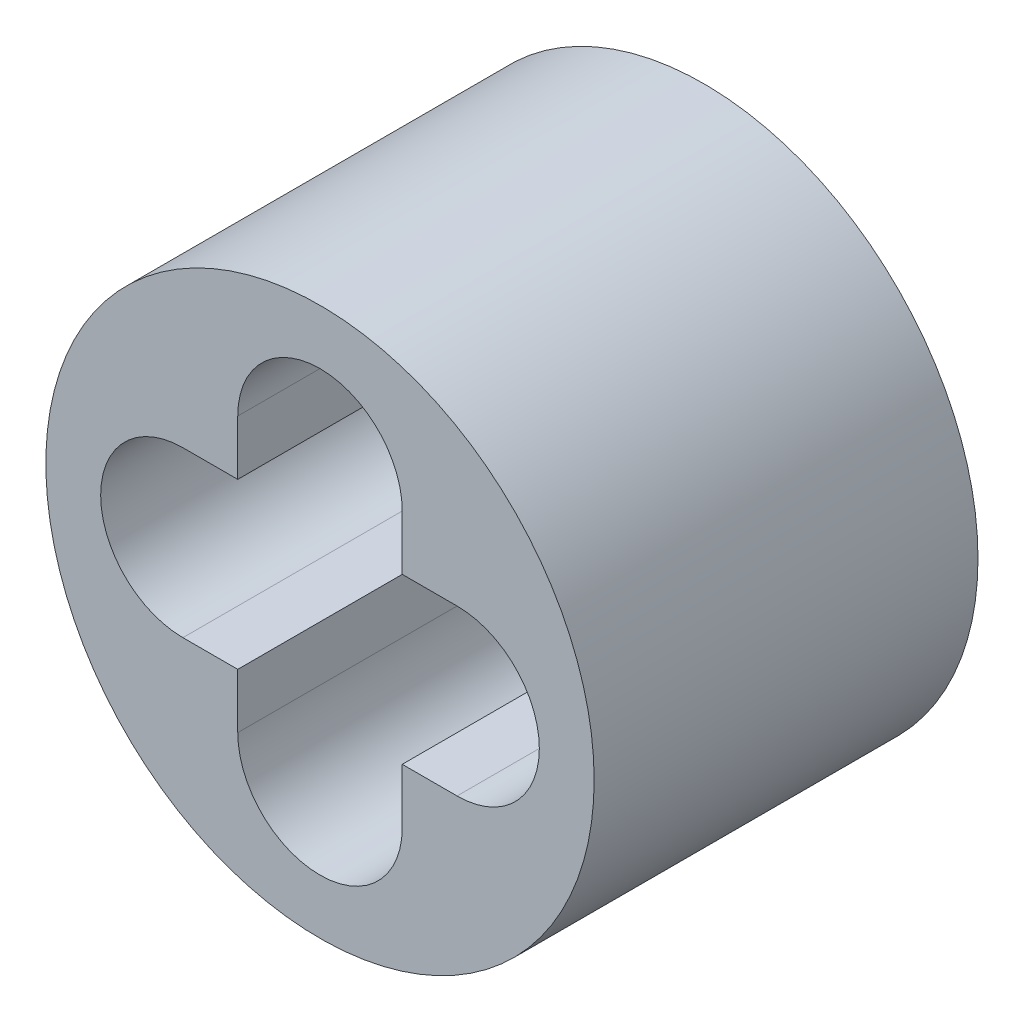
ISO-10303-21;
HEADER;
FILE_DESCRIPTION(('STEP AP214'),'2;1');
FILE_NAME('part.step','',(''),(''),'','','');
FILE_SCHEMA(('AUTOMOTIVE_DESIGN { 1 0 10303 214 1 1 1 1 }'));
ENDSEC;
DATA;
#1=APPLICATION_CONTEXT('core data for automotive mechanical design processes');
#2=APPLICATION_PROTOCOL_DEFINITION('international standard','automotive_design',2000,#1);
#3=PRODUCT_CONTEXT('',#1,'mechanical');
#4=PRODUCT('Part','Part','',(#3));
#5=PRODUCT_RELATED_PRODUCT_CATEGORY('part','',(#4));
#6=PRODUCT_DEFINITION_FORMATION('','',#4);
#7=PRODUCT_DEFINITION_CONTEXT('part definition',#1,'design');
#8=PRODUCT_DEFINITION('design','',#6,#7);
#9=PRODUCT_DEFINITION_SHAPE('','',#8);
#10=(LENGTH_UNIT() NAMED_UNIT(*) SI_UNIT(.MILLI.,.METRE.));
#11=(NAMED_UNIT(*) PLANE_ANGLE_UNIT() SI_UNIT($,.RADIAN.));
#12=(NAMED_UNIT(*) SI_UNIT($,.STERADIAN.) SOLID_ANGLE_UNIT());
#13=UNCERTAINTY_MEASURE_WITH_UNIT(LENGTH_MEASURE(1.E-05),#10,'distance_accuracy_value','');
#14=(GEOMETRIC_REPRESENTATION_CONTEXT(3) GLOBAL_UNCERTAINTY_ASSIGNED_CONTEXT((#13)) GLOBAL_UNIT_ASSIGNED_CONTEXT((#10,
#11,#12)) REPRESENTATION_CONTEXT('',''));
#15=CARTESIAN_POINT('',(0.,0.,0.));
#16=DIRECTION('',(0.,0.,1.));
#17=DIRECTION('',(1.,0.,0.));
#18=AXIS2_PLACEMENT_3D('',#15,#16,#17);
#19=CARTESIAN_POINT('',(0.,0.,7.));
#20=DIRECTION('',(0.,0.,1.));
#21=DIRECTION('',(1.,0.,0.));
#22=AXIS2_PLACEMENT_3D('',#19,#20,#21);
#23=PLANE('',#22);
#24=CARTESIAN_POINT('',(0.,0.,7.));
#25=DIRECTION('',(0.,0.,1.));
#26=DIRECTION('',(1.,0.,0.));
#27=AXIS2_PLACEMENT_3D('',#24,#25,#26);
#28=CIRCLE('',#27,5.);
#29=CARTESIAN_POINT('',(5.,0.,7.));
#30=VERTEX_POINT('',#29);
#31=EDGE_CURVE('E11',#30,#30,#28,.T.);
#32=ORIENTED_EDGE('',*,*,#31,.T.);
#33=EDGE_LOOP('',(#32));
#34=FACE_BOUND('',#33,.T.);
#35=DIRECTION('',(1.,0.,0.));
#36=VECTOR('',#35,1.);
#37=CARTESIAN_POINT('',(-2.5,-1.5,7.));
#38=LINE('',#37,#36);
#39=CARTESIAN_POINT('',(-2.5,-1.5,7.));
#40=VERTEX_POINT('',#39);
#41=CARTESIAN_POINT('',(-1.5,-1.5,7.));
#42=VERTEX_POINT('',#41);
#43=EDGE_CURVE('E138',#40,#42,#38,.T.);
#44=ORIENTED_EDGE('',*,*,#43,.F.);
#45=CARTESIAN_POINT('',(-2.5,0.,7.));
#46=DIRECTION('',(0.,0.,1.));
#47=DIRECTION('',(1.,0.,0.));
#48=AXIS2_PLACEMENT_3D('',#45,#46,#47);
#49=CIRCLE('',#48,1.5);
#50=CARTESIAN_POINT('',(-2.5,1.5,7.));
#51=VERTEX_POINT('',#50);
#52=EDGE_CURVE('E129',#51,#40,#49,.T.);
#53=ORIENTED_EDGE('',*,*,#52,.F.);
#54=DIRECTION('',(-1.,0.,0.));
#55=VECTOR('',#54,1.);
#56=CARTESIAN_POINT('',(-2.5,1.5,7.));
#57=LINE('',#56,#55);
#58=CARTESIAN_POINT('',(-1.5,1.5,7.));
#59=VERTEX_POINT('',#58);
#60=EDGE_CURVE('E181',#59,#51,#57,.T.);
#61=ORIENTED_EDGE('',*,*,#60,.F.);
#62=DIRECTION('',(0.,-1.,0.));
#63=VECTOR('',#62,1.);
#64=CARTESIAN_POINT('',(-1.5,2.5,7.));
#65=LINE('',#64,#63);
#66=CARTESIAN_POINT('',(-1.5,2.5,7.));
#67=VERTEX_POINT('',#66);
#68=EDGE_CURVE('E178',#67,#59,#65,.T.);
#69=ORIENTED_EDGE('',*,*,#68,.F.);
#70=CARTESIAN_POINT('',(0.,2.5,7.));
#71=DIRECTION('',(0.,0.,1.));
#72=DIRECTION('',(1.,0.,0.));
#73=AXIS2_PLACEMENT_3D('',#70,#71,#72);
#74=CIRCLE('',#73,1.5);
#75=CARTESIAN_POINT('',(1.5,2.5,7.));
#76=VERTEX_POINT('',#75);
#77=EDGE_CURVE('E175',#76,#67,#74,.T.);
#78=ORIENTED_EDGE('',*,*,#77,.F.);
#79=DIRECTION('',(0.,1.,0.));
#80=VECTOR('',#79,1.);
#81=CARTESIAN_POINT('',(1.5,2.5,7.));
#82=LINE('',#81,#80);
#83=CARTESIAN_POINT('',(1.5,1.5,7.));
#84=VERTEX_POINT('',#83);
#85=EDGE_CURVE('E172',#84,#76,#82,.T.);
#86=ORIENTED_EDGE('',*,*,#85,.F.);
#87=DIRECTION('',(-1.,0.,0.));
#88=VECTOR('',#87,1.);
#89=CARTESIAN_POINT('',(1.5,1.5,7.));
#90=LINE('',#89,#88);
#91=CARTESIAN_POINT('',(2.5,1.5,7.));
#92=VERTEX_POINT('',#91);
#93=EDGE_CURVE('E169',#92,#84,#90,.T.);
#94=ORIENTED_EDGE('',*,*,#93,.F.);
#95=CARTESIAN_POINT('',(2.5,0.,7.));
#96=DIRECTION('',(0.,0.,1.));
#97=DIRECTION('',(1.,0.,0.));
#98=AXIS2_PLACEMENT_3D('',#95,#96,#97);
#99=CIRCLE('',#98,1.5);
#100=CARTESIAN_POINT('',(2.5,-1.5,7.));
#101=VERTEX_POINT('',#100);
#102=EDGE_CURVE('E166',#101,#92,#99,.T.);
#103=ORIENTED_EDGE('',*,*,#102,.F.);
#104=DIRECTION('',(1.,0.,0.));
#105=VECTOR('',#104,1.);
#106=CARTESIAN_POINT('',(1.5,-1.5,7.));
#107=LINE('',#106,#105);
#108=CARTESIAN_POINT('',(1.5,-1.5,7.));
#109=VERTEX_POINT('',#108);
#110=EDGE_CURVE('E163',#109,#101,#107,.T.);
#111=ORIENTED_EDGE('',*,*,#110,.F.);
#112=DIRECTION('',(0.,1.,0.));
#113=VECTOR('',#112,1.);
#114=CARTESIAN_POINT('',(1.5,-1.5,7.));
#115=LINE('',#114,#113);
#116=CARTESIAN_POINT('',(1.5,-2.5,7.));
#117=VERTEX_POINT('',#116);
#118=EDGE_CURVE('E160',#117,#109,#115,.T.);
#119=ORIENTED_EDGE('',*,*,#118,.F.);
#120=CARTESIAN_POINT('',(0.,-2.5,7.));
#121=DIRECTION('',(0.,0.,1.));
#122=DIRECTION('',(1.,0.,0.));
#123=AXIS2_PLACEMENT_3D('',#120,#121,#122);
#124=CIRCLE('',#123,1.5);
#125=CARTESIAN_POINT('',(-1.5,-2.5,7.));
#126=VERTEX_POINT('',#125);
#127=EDGE_CURVE('E155',#126,#117,#124,.T.);
#128=ORIENTED_EDGE('',*,*,#127,.F.);
#129=DIRECTION('',(0.,-1.,0.));
#130=VECTOR('',#129,1.);
#131=CARTESIAN_POINT('',(-1.5,-1.5,7.));
#132=LINE('',#131,#130);
#133=EDGE_CURVE('E151',#42,#126,#132,.T.);
#134=ORIENTED_EDGE('',*,*,#133,.F.);
#135=EDGE_LOOP('',(#44,#53,#61,#69,#78,#86,#94,#103,#111,#119,#128,#134));
#136=FACE_BOUND('',#135,.T.);
#137=ADVANCED_FACE('F39',(#34,#136),#23,.T.);
#138=CARTESIAN_POINT('',(0.,0.,0.));
#139=DIRECTION('',(0.,0.,1.));
#140=DIRECTION('',(1.,0.,0.));
#141=AXIS2_PLACEMENT_3D('',#138,#139,#140);
#142=PLANE('',#141);
#143=CARTESIAN_POINT('',(0.,0.,0.));
#144=DIRECTION('',(0.,0.,1.));
#145=DIRECTION('',(1.,0.,0.));
#146=AXIS2_PLACEMENT_3D('',#143,#144,#145);
#147=CIRCLE('',#146,5.);
#148=CARTESIAN_POINT('',(5.,0.,0.));
#149=VERTEX_POINT('',#148);
#150=EDGE_CURVE('E43',#149,#149,#147,.T.);
#151=ORIENTED_EDGE('',*,*,#150,.F.);
#152=EDGE_LOOP('',(#151));
#153=FACE_BOUND('',#152,.T.);
#154=CARTESIAN_POINT('',(-2.5,0.,0.));
#155=DIRECTION('',(0.,0.,1.));
#156=DIRECTION('',(1.,0.,0.));
#157=AXIS2_PLACEMENT_3D('',#154,#155,#156);
#158=CIRCLE('',#157,1.5);
#159=CARTESIAN_POINT('',(-2.5,1.5,0.));
#160=VERTEX_POINT('',#159);
#161=CARTESIAN_POINT('',(-2.5,-1.5,0.));
#162=VERTEX_POINT('',#161);
#163=EDGE_CURVE('E63',#160,#162,#158,.T.);
#164=ORIENTED_EDGE('',*,*,#163,.T.);
#165=DIRECTION('',(1.,0.,0.));
#166=VECTOR('',#165,1.);
#167=CARTESIAN_POINT('',(-2.5,-1.5,0.));
#168=LINE('',#167,#166);
#169=CARTESIAN_POINT('',(-1.5,-1.5,0.));
#170=VERTEX_POINT('',#169);
#171=EDGE_CURVE('E145',#162,#170,#168,.T.);
#172=ORIENTED_EDGE('',*,*,#171,.T.);
#173=DIRECTION('',(0.,-1.,0.));
#174=VECTOR('',#173,1.);
#175=CARTESIAN_POINT('',(-1.5,-1.5,0.));
#176=LINE('',#175,#174);
#177=CARTESIAN_POINT('',(-1.5,-2.5,0.));
#178=VERTEX_POINT('',#177);
#179=EDGE_CURVE('E188',#170,#178,#176,.T.);
#180=ORIENTED_EDGE('',*,*,#179,.T.);
#181=CARTESIAN_POINT('',(0.,-2.5,0.));
#182=DIRECTION('',(0.,0.,1.));
#183=DIRECTION('',(1.,0.,0.));
#184=AXIS2_PLACEMENT_3D('',#181,#182,#183);
#185=CIRCLE('',#184,1.5);
#186=CARTESIAN_POINT('',(1.5,-2.5,0.));
#187=VERTEX_POINT('',#186);
#188=EDGE_CURVE('E192',#178,#187,#185,.T.);
#189=ORIENTED_EDGE('',*,*,#188,.T.);
#190=DIRECTION('',(0.,1.,0.));
#191=VECTOR('',#190,1.);
#192=CARTESIAN_POINT('',(1.5,-1.5,0.));
#193=LINE('',#192,#191);
#194=CARTESIAN_POINT('',(1.5,-1.5,0.));
#195=VERTEX_POINT('',#194);
#196=EDGE_CURVE('E196',#187,#195,#193,.T.);
#197=ORIENTED_EDGE('',*,*,#196,.T.);
#198=DIRECTION('',(1.,0.,0.));
#199=VECTOR('',#198,1.);
#200=CARTESIAN_POINT('',(1.5,-1.5,0.));
#201=LINE('',#200,#199);
#202=CARTESIAN_POINT('',(2.5,-1.5,0.));
#203=VERTEX_POINT('',#202);
#204=EDGE_CURVE('E200',#195,#203,#201,.T.);
#205=ORIENTED_EDGE('',*,*,#204,.T.);
#206=CARTESIAN_POINT('',(2.5,0.,0.));
#207=DIRECTION('',(0.,0.,1.));
#208=DIRECTION('',(1.,0.,0.));
#209=AXIS2_PLACEMENT_3D('',#206,#207,#208);
#210=CIRCLE('',#209,1.5);
#211=CARTESIAN_POINT('',(2.5,1.5,0.));
#212=VERTEX_POINT('',#211);
#213=EDGE_CURVE('E204',#203,#212,#210,.T.);
#214=ORIENTED_EDGE('',*,*,#213,.T.);
#215=DIRECTION('',(-1.,0.,0.));
#216=VECTOR('',#215,1.);
#217=CARTESIAN_POINT('',(1.5,1.5,0.));
#218=LINE('',#217,#216);
#219=CARTESIAN_POINT('',(1.5,1.5,0.));
#220=VERTEX_POINT('',#219);
#221=EDGE_CURVE('E208',#212,#220,#218,.T.);
#222=ORIENTED_EDGE('',*,*,#221,.T.);
#223=DIRECTION('',(0.,1.,0.));
#224=VECTOR('',#223,1.);
#225=CARTESIAN_POINT('',(1.5,2.5,0.));
#226=LINE('',#225,#224);
#227=CARTESIAN_POINT('',(1.5,2.5,0.));
#228=VERTEX_POINT('',#227);
#229=EDGE_CURVE('E212',#220,#228,#226,.T.);
#230=ORIENTED_EDGE('',*,*,#229,.T.);
#231=CARTESIAN_POINT('',(0.,2.5,0.));
#232=DIRECTION('',(0.,0.,1.));
#233=DIRECTION('',(1.,0.,0.));
#234=AXIS2_PLACEMENT_3D('',#231,#232,#233);
#235=CIRCLE('',#234,1.5);
#236=CARTESIAN_POINT('',(-1.5,2.5,0.));
#237=VERTEX_POINT('',#236);
#238=EDGE_CURVE('E216',#228,#237,#235,.T.);
#239=ORIENTED_EDGE('',*,*,#238,.T.);
#240=DIRECTION('',(0.,-1.,0.));
#241=VECTOR('',#240,1.);
#242=CARTESIAN_POINT('',(-1.5,2.5,0.));
#243=LINE('',#242,#241);
#244=CARTESIAN_POINT('',(-1.5,1.5,0.));
#245=VERTEX_POINT('',#244);
#246=EDGE_CURVE('E220',#237,#245,#243,.T.);
#247=ORIENTED_EDGE('',*,*,#246,.T.);
#248=DIRECTION('',(-1.,0.,0.));
#249=VECTOR('',#248,1.);
#250=CARTESIAN_POINT('',(-2.5,1.5,0.));
#251=LINE('',#250,#249);
#252=EDGE_CURVE('E139',#245,#160,#251,.T.);
#253=ORIENTED_EDGE('',*,*,#252,.T.);
#254=EDGE_LOOP('',(#164,#172,#180,#189,#197,#205,#214,#222,#230,#239,#247,#253));
#255=FACE_BOUND('',#254,.T.);
#256=ADVANCED_FACE('F262',(#153,#255),#142,.F.);
#257=CARTESIAN_POINT('',(0.,0.,7.));
#258=DIRECTION('',(0.,0.,-1.));
#259=DIRECTION('',(-1.,0.,0.));
#260=AXIS2_PLACEMENT_3D('',#257,#258,#259);
#261=CYLINDRICAL_SURFACE('',#260,5.);
#262=ORIENTED_EDGE('',*,*,#31,.F.);
#263=EDGE_LOOP('',(#262));
#264=FACE_BOUND('',#263,.T.);
#265=ORIENTED_EDGE('',*,*,#150,.T.);
#266=EDGE_LOOP('',(#265));
#267=FACE_BOUND('',#266,.T.);
#268=ADVANCED_FACE('F41',(#264,#267),#261,.T.);
#269=CARTESIAN_POINT('',(-2.5,0.,7.));
#270=DIRECTION('',(0.,0.,-1.));
#271=DIRECTION('',(-1.,0.,0.));
#272=AXIS2_PLACEMENT_3D('',#269,#270,#271);
#273=CYLINDRICAL_SURFACE('',#272,1.5);
#274=ORIENTED_EDGE('',*,*,#163,.F.);
#275=DIRECTION('',(0.,0.,-1.));
#276=VECTOR('',#275,1.);
#277=CARTESIAN_POINT('',(-2.5,1.5,7.));
#278=LINE('',#277,#276);
#279=EDGE_CURVE('E133',#51,#160,#278,.T.);
#280=ORIENTED_EDGE('',*,*,#279,.F.);
#281=ORIENTED_EDGE('',*,*,#52,.T.);
#282=DIRECTION('',(0.,0.,-1.));
#283=VECTOR('',#282,1.);
#284=CARTESIAN_POINT('',(-2.5,-1.5,7.));
#285=LINE('',#284,#283);
#286=EDGE_CURVE('E132',#40,#162,#285,.T.);
#287=ORIENTED_EDGE('',*,*,#286,.T.);
#288=EDGE_LOOP('',(#274,#280,#281,#287));
#289=FACE_BOUND('',#288,.T.);
#290=ADVANCED_FACE('F131',(#289),#273,.F.);
#291=CARTESIAN_POINT('',(-2.5,-1.5,7.));
#292=DIRECTION('',(0.,1.,0.));
#293=DIRECTION('',(0.,0.,1.));
#294=AXIS2_PLACEMENT_3D('',#291,#292,#293);
#295=PLANE('',#294);
#296=ORIENTED_EDGE('',*,*,#171,.F.);
#297=ORIENTED_EDGE('',*,*,#286,.F.);
#298=ORIENTED_EDGE('',*,*,#43,.T.);
#299=DIRECTION('',(0.,0.,-1.));
#300=VECTOR('',#299,1.);
#301=CARTESIAN_POINT('',(-1.5,-1.5,7.));
#302=LINE('',#301,#300);
#303=EDGE_CURVE('E147',#42,#170,#302,.T.);
#304=ORIENTED_EDGE('',*,*,#303,.T.);
#305=EDGE_LOOP('',(#296,#297,#298,#304));
#306=FACE_BOUND('',#305,.T.);
#307=ADVANCED_FACE('F142',(#306),#295,.T.);
#308=CARTESIAN_POINT('',(-1.5,-1.5,7.));
#309=DIRECTION('',(1.,0.,0.));
#310=DIRECTION('',(0.,0.,-1.));
#311=AXIS2_PLACEMENT_3D('',#308,#309,#310);
#312=PLANE('',#311);
#313=ORIENTED_EDGE('',*,*,#179,.F.);
#314=ORIENTED_EDGE('',*,*,#303,.F.);
#315=ORIENTED_EDGE('',*,*,#133,.T.);
#316=DIRECTION('',(0.,0.,-1.));
#317=VECTOR('',#316,1.);
#318=CARTESIAN_POINT('',(-1.5,-2.5,7.));
#319=LINE('',#318,#317);
#320=EDGE_CURVE('E252',#126,#178,#319,.T.);
#321=ORIENTED_EDGE('',*,*,#320,.T.);
#322=EDGE_LOOP('',(#313,#314,#315,#321));
#323=FACE_BOUND('',#322,.T.);
#324=ADVANCED_FACE('F258',(#323),#312,.T.);
#325=CARTESIAN_POINT('',(0.,-2.5,7.));
#326=DIRECTION('',(0.,0.,-1.));
#327=DIRECTION('',(-1.,0.,0.));
#328=AXIS2_PLACEMENT_3D('',#325,#326,#327);
#329=CYLINDRICAL_SURFACE('',#328,1.5);
#330=ORIENTED_EDGE('',*,*,#188,.F.);
#331=ORIENTED_EDGE('',*,*,#320,.F.);
#332=ORIENTED_EDGE('',*,*,#127,.T.);
#333=DIRECTION('',(0.,0.,-1.));
#334=VECTOR('',#333,1.);
#335=CARTESIAN_POINT('',(1.5,-2.5,7.));
#336=LINE('',#335,#334);
#337=EDGE_CURVE('E249',#117,#187,#336,.T.);
#338=ORIENTED_EDGE('',*,*,#337,.T.);
#339=EDGE_LOOP('',(#330,#331,#332,#338));
#340=FACE_BOUND('',#339,.T.);
#341=ADVANCED_FACE('F300',(#340),#329,.F.);
#342=CARTESIAN_POINT('',(1.5,-1.5,7.));
#343=DIRECTION('',(-1.,0.,0.));
#344=DIRECTION('',(0.,0.,1.));
#345=AXIS2_PLACEMENT_3D('',#342,#343,#344);
#346=PLANE('',#345);
#347=ORIENTED_EDGE('',*,*,#196,.F.);
#348=ORIENTED_EDGE('',*,*,#337,.F.);
#349=ORIENTED_EDGE('',*,*,#118,.T.);
#350=DIRECTION('',(0.,0.,-1.));
#351=VECTOR('',#350,1.);
#352=CARTESIAN_POINT('',(1.5,-1.5,7.));
#353=LINE('',#352,#351);
#354=EDGE_CURVE('E246',#109,#195,#353,.T.);
#355=ORIENTED_EDGE('',*,*,#354,.T.);
#356=EDGE_LOOP('',(#347,#348,#349,#355));
#357=FACE_BOUND('',#356,.T.);
#358=ADVANCED_FACE('F298',(#357),#346,.T.);
#359=CARTESIAN_POINT('',(1.5,-1.5,7.));
#360=DIRECTION('',(0.,1.,0.));
#361=DIRECTION('',(0.,0.,1.));
#362=AXIS2_PLACEMENT_3D('',#359,#360,#361);
#363=PLANE('',#362);
#364=ORIENTED_EDGE('',*,*,#204,.F.);
#365=ORIENTED_EDGE('',*,*,#354,.F.);
#366=ORIENTED_EDGE('',*,*,#110,.T.);
#367=DIRECTION('',(0.,0.,-1.));
#368=VECTOR('',#367,1.);
#369=CARTESIAN_POINT('',(2.5,-1.5,7.));
#370=LINE('',#369,#368);
#371=EDGE_CURVE('E243',#101,#203,#370,.T.);
#372=ORIENTED_EDGE('',*,*,#371,.T.);
#373=EDGE_LOOP('',(#364,#365,#366,#372));
#374=FACE_BOUND('',#373,.T.);
#375=ADVANCED_FACE('F292',(#374),#363,.T.);
#376=CARTESIAN_POINT('',(2.5,0.,7.));
#377=DIRECTION('',(0.,0.,-1.));
#378=DIRECTION('',(-1.,0.,0.));
#379=AXIS2_PLACEMENT_3D('',#376,#377,#378);
#380=CYLINDRICAL_SURFACE('',#379,1.5);
#381=ORIENTED_EDGE('',*,*,#213,.F.);
#382=ORIENTED_EDGE('',*,*,#371,.F.);
#383=ORIENTED_EDGE('',*,*,#102,.T.);
#384=DIRECTION('',(0.,0.,-1.));
#385=VECTOR('',#384,1.);
#386=CARTESIAN_POINT('',(2.5,1.5,7.));
#387=LINE('',#386,#385);
#388=EDGE_CURVE('E240',#92,#212,#387,.T.);
#389=ORIENTED_EDGE('',*,*,#388,.T.);
#390=EDGE_LOOP('',(#381,#382,#383,#389));
#391=FACE_BOUND('',#390,.T.);
#392=ADVANCED_FACE('F288',(#391),#380,.F.);
#393=CARTESIAN_POINT('',(1.5,1.5,7.));
#394=DIRECTION('',(0.,-1.,0.));
#395=DIRECTION('',(0.,0.,-1.));
#396=AXIS2_PLACEMENT_3D('',#393,#394,#395);
#397=PLANE('',#396);
#398=ORIENTED_EDGE('',*,*,#221,.F.);
#399=ORIENTED_EDGE('',*,*,#388,.F.);
#400=ORIENTED_EDGE('',*,*,#93,.T.);
#401=DIRECTION('',(0.,0.,-1.));
#402=VECTOR('',#401,1.);
#403=CARTESIAN_POINT('',(1.5,1.5,7.));
#404=LINE('',#403,#402);
#405=EDGE_CURVE('E237',#84,#220,#404,.T.);
#406=ORIENTED_EDGE('',*,*,#405,.T.);
#407=EDGE_LOOP('',(#398,#399,#400,#406));
#408=FACE_BOUND('',#407,.T.);
#409=ADVANCED_FACE('F285',(#408),#397,.T.);
#410=CARTESIAN_POINT('',(1.5,2.5,7.));
#411=DIRECTION('',(-1.,0.,0.));
#412=DIRECTION('',(0.,0.,1.));
#413=AXIS2_PLACEMENT_3D('',#410,#411,#412);
#414=PLANE('',#413);
#415=ORIENTED_EDGE('',*,*,#229,.F.);
#416=ORIENTED_EDGE('',*,*,#405,.F.);
#417=ORIENTED_EDGE('',*,*,#85,.T.);
#418=DIRECTION('',(0.,0.,-1.));
#419=VECTOR('',#418,1.);
#420=CARTESIAN_POINT('',(1.5,2.5,7.));
#421=LINE('',#420,#419);
#422=EDGE_CURVE('E234',#76,#228,#421,.T.);
#423=ORIENTED_EDGE('',*,*,#422,.T.);
#424=EDGE_LOOP('',(#415,#416,#417,#423));
#425=FACE_BOUND('',#424,.T.);
#426=ADVANCED_FACE('F277',(#425),#414,.T.);
#427=CARTESIAN_POINT('',(0.,2.5,7.));
#428=DIRECTION('',(0.,0.,-1.));
#429=DIRECTION('',(-1.,0.,0.));
#430=AXIS2_PLACEMENT_3D('',#427,#428,#429);
#431=CYLINDRICAL_SURFACE('',#430,1.5);
#432=ORIENTED_EDGE('',*,*,#238,.F.);
#433=ORIENTED_EDGE('',*,*,#422,.F.);
#434=ORIENTED_EDGE('',*,*,#77,.T.);
#435=DIRECTION('',(0.,0.,-1.));
#436=VECTOR('',#435,1.);
#437=CARTESIAN_POINT('',(-1.5,2.5,7.));
#438=LINE('',#437,#436);
#439=EDGE_CURVE('E231',#67,#237,#438,.T.);
#440=ORIENTED_EDGE('',*,*,#439,.T.);
#441=EDGE_LOOP('',(#432,#433,#434,#440));
#442=FACE_BOUND('',#441,.T.);
#443=ADVANCED_FACE('F273',(#442),#431,.F.);
#444=CARTESIAN_POINT('',(-1.5,2.5,7.));
#445=DIRECTION('',(1.,0.,0.));
#446=DIRECTION('',(0.,0.,-1.));
#447=AXIS2_PLACEMENT_3D('',#444,#445,#446);
#448=PLANE('',#447);
#449=ORIENTED_EDGE('',*,*,#246,.F.);
#450=ORIENTED_EDGE('',*,*,#439,.F.);
#451=ORIENTED_EDGE('',*,*,#68,.T.);
#452=DIRECTION('',(0.,0.,-1.));
#453=VECTOR('',#452,1.);
#454=CARTESIAN_POINT('',(-1.5,1.5,7.));
#455=LINE('',#454,#453);
#456=EDGE_CURVE('E55',#59,#245,#455,.T.);
#457=ORIENTED_EDGE('',*,*,#456,.T.);
#458=EDGE_LOOP('',(#449,#450,#451,#457));
#459=FACE_BOUND('',#458,.T.);
#460=ADVANCED_FACE('F270',(#459),#448,.T.);
#461=CARTESIAN_POINT('',(-2.5,1.5,7.));
#462=DIRECTION('',(0.,-1.,0.));
#463=DIRECTION('',(0.,0.,-1.));
#464=AXIS2_PLACEMENT_3D('',#461,#462,#463);
#465=PLANE('',#464);
#466=ORIENTED_EDGE('',*,*,#252,.F.);
#467=ORIENTED_EDGE('',*,*,#456,.F.);
#468=ORIENTED_EDGE('',*,*,#60,.T.);
#469=ORIENTED_EDGE('',*,*,#279,.T.);
#470=EDGE_LOOP('',(#466,#467,#468,#469));
#471=FACE_BOUND('',#470,.T.);
#472=ADVANCED_FACE('F264',(#471),#465,.T.);
#473=CLOSED_SHELL('',(#137,#256,#268,#290,#307,#324,#341,#358,#375,#392,#409,#426,#443,#460,#472));
#474=MANIFOLD_SOLID_BREP('B2',#473);
#475=ADVANCED_BREP_SHAPE_REPRESENTATION('',(#18,#474),#14);
#476=SHAPE_DEFINITION_REPRESENTATION(#9,#475);
ENDSEC;
END-ISO-10303-21;
